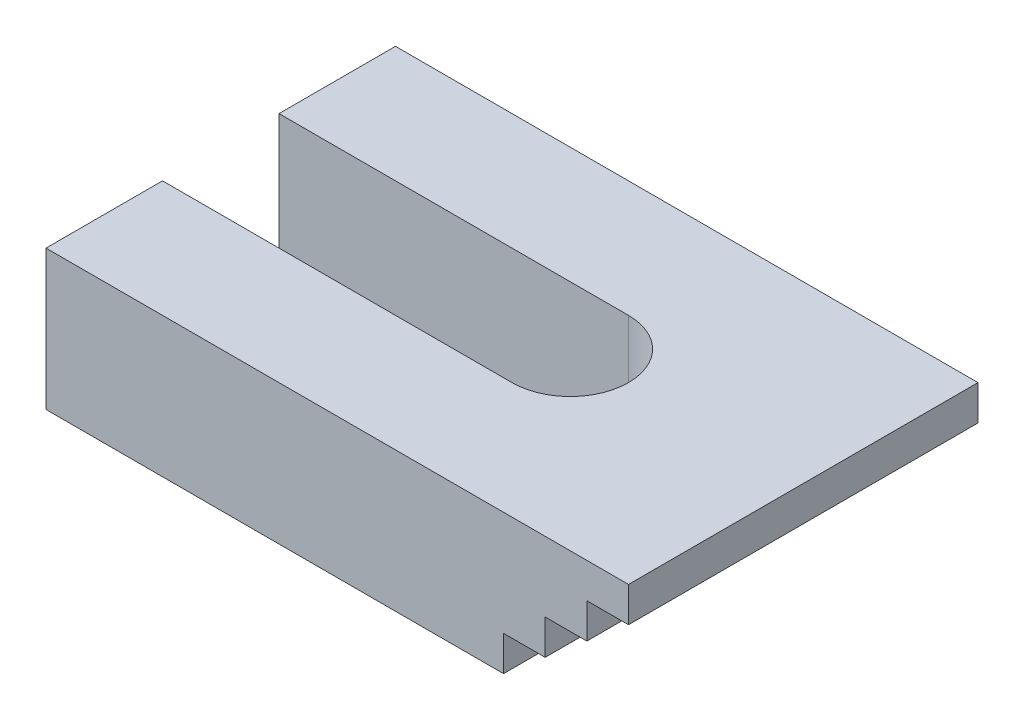
ISO-10303-21;
HEADER;
FILE_DESCRIPTION(('STEP AP214'),'2;1');
FILE_NAME('part.step','',(''),(''),'','','');
FILE_SCHEMA(('AUTOMOTIVE_DESIGN { 1 0 10303 214 1 1 1 1 }'));
ENDSEC;
DATA;
#1=APPLICATION_CONTEXT('core data for automotive mechanical design processes');
#2=APPLICATION_PROTOCOL_DEFINITION('international standard','automotive_design',2000,#1);
#3=PRODUCT_CONTEXT('',#1,'mechanical');
#4=PRODUCT('Part','Part','',(#3));
#5=PRODUCT_RELATED_PRODUCT_CATEGORY('part','',(#4));
#6=PRODUCT_DEFINITION_FORMATION('','',#4);
#7=PRODUCT_DEFINITION_CONTEXT('part definition',#1,'design');
#8=PRODUCT_DEFINITION('design','',#6,#7);
#9=PRODUCT_DEFINITION_SHAPE('','',#8);
#10=(LENGTH_UNIT() NAMED_UNIT(*) SI_UNIT(.MILLI.,.METRE.));
#11=(NAMED_UNIT(*) PLANE_ANGLE_UNIT() SI_UNIT($,.RADIAN.));
#12=(NAMED_UNIT(*) SI_UNIT($,.STERADIAN.) SOLID_ANGLE_UNIT());
#13=UNCERTAINTY_MEASURE_WITH_UNIT(LENGTH_MEASURE(1.E-05),#10,'distance_accuracy_value','');
#14=(GEOMETRIC_REPRESENTATION_CONTEXT(3) GLOBAL_UNCERTAINTY_ASSIGNED_CONTEXT((#13)) GLOBAL_UNIT_ASSIGNED_CONTEXT((#10,
#11,#12)) REPRESENTATION_CONTEXT('',''));
#15=CARTESIAN_POINT('',(0.,0.,0.));
#16=DIRECTION('',(0.,0.,1.));
#17=DIRECTION('',(1.,0.,0.));
#18=AXIS2_PLACEMENT_3D('',#15,#16,#17);
#19=CARTESIAN_POINT('',(-39.274217666652,0.,30.));
#20=DIRECTION('',(1.,0.,0.));
#21=DIRECTION('',(0.,0.,-1.));
#22=AXIS2_PLACEMENT_3D('',#19,#20,#21);
#23=PLANE('',#22);
#24=DIRECTION('',(0.,0.,-1.));
#25=VECTOR('',#24,1.);
#26=CARTESIAN_POINT('',(-39.274217666652,0.,30.));
#27=LINE('',#26,#25);
#28=CARTESIAN_POINT('',(-39.274217666652,0.,9.99999999999999));
#29=VERTEX_POINT('',#28);
#30=CARTESIAN_POINT('',(-39.274217666652,0.,0.));
#31=VERTEX_POINT('',#30);
#32=EDGE_CURVE('E206',#29,#31,#27,.T.);
#33=ORIENTED_EDGE('',*,*,#32,.F.);
#34=DIRECTION('',(0.,-1.,0.));
#35=VECTOR('',#34,1.);
#36=CARTESIAN_POINT('',(-39.274217666652,12.,9.99999999999999));
#37=LINE('',#36,#35);
#38=CARTESIAN_POINT('',(-39.274217666652,12.,9.99999999999999));
#39=VERTEX_POINT('',#38);
#40=EDGE_CURVE('E273',#39,#29,#37,.T.);
#41=ORIENTED_EDGE('',*,*,#40,.F.);
#42=DIRECTION('',(0.,0.,-1.));
#43=VECTOR('',#42,1.);
#44=CARTESIAN_POINT('',(-39.274217666652,12.,30.));
#45=LINE('',#44,#43);
#46=CARTESIAN_POINT('',(-39.274217666652,12.,0.));
#47=VERTEX_POINT('',#46);
#48=EDGE_CURVE('E158',#39,#47,#45,.T.);
#49=ORIENTED_EDGE('',*,*,#48,.T.);
#50=DIRECTION('',(0.,-1.,0.));
#51=VECTOR('',#50,1.);
#52=CARTESIAN_POINT('',(-39.274217666652,0.,0.));
#53=LINE('',#52,#51);
#54=EDGE_CURVE('E197',#47,#31,#53,.T.);
#55=ORIENTED_EDGE('',*,*,#54,.T.);
#56=EDGE_LOOP('',(#33,#41,#49,#55));
#57=FACE_BOUND('',#56,.T.);
#58=ADVANCED_FACE('F39',(#57),#23,.F.);
#59=CARTESIAN_POINT('',(0.,0.,30.));
#60=DIRECTION('',(-1.,0.,0.));
#61=DIRECTION('',(0.,0.,1.));
#62=AXIS2_PLACEMENT_3D('',#59,#60,#61);
#63=PLANE('',#62);
#64=DIRECTION('',(0.,1.,0.));
#65=VECTOR('',#64,1.);
#66=CARTESIAN_POINT('',(0.,0.,0.));
#67=LINE('',#66,#65);
#68=CARTESIAN_POINT('',(0.,0.,0.));
#69=VERTEX_POINT('',#68);
#70=CARTESIAN_POINT('',(0.,3.,0.));
#71=VERTEX_POINT('',#70);
#72=EDGE_CURVE('E170',#69,#71,#67,.T.);
#73=ORIENTED_EDGE('',*,*,#72,.T.);
#74=DIRECTION('',(0.,0.,-1.));
#75=VECTOR('',#74,1.);
#76=CARTESIAN_POINT('',(0.,3.,30.));
#77=LINE('',#76,#75);
#78=CARTESIAN_POINT('',(0.,3.,30.));
#79=VERTEX_POINT('',#78);
#80=EDGE_CURVE('E11',#79,#71,#77,.T.);
#81=ORIENTED_EDGE('',*,*,#80,.F.);
#82=DIRECTION('',(0.,1.,0.));
#83=VECTOR('',#82,1.);
#84=CARTESIAN_POINT('',(0.,0.,30.));
#85=LINE('',#84,#83);
#86=CARTESIAN_POINT('',(0.,0.,30.));
#87=VERTEX_POINT('',#86);
#88=EDGE_CURVE('E203',#87,#79,#85,.T.);
#89=ORIENTED_EDGE('',*,*,#88,.F.);
#90=DIRECTION('',(0.,0.,-1.));
#91=VECTOR('',#90,1.);
#92=CARTESIAN_POINT('',(0.,0.,30.));
#93=LINE('',#92,#91);
#94=EDGE_CURVE('E166',#87,#69,#93,.T.);
#95=ORIENTED_EDGE('',*,*,#94,.T.);
#96=EDGE_LOOP('',(#73,#81,#89,#95));
#97=FACE_BOUND('',#96,.T.);
#98=ADVANCED_FACE('F41',(#97),#63,.F.);
#99=CARTESIAN_POINT('',(0.,3.,30.));
#100=DIRECTION('',(0.,1.,0.));
#101=DIRECTION('',(0.,0.,1.));
#102=AXIS2_PLACEMENT_3D('',#99,#100,#101);
#103=PLANE('',#102);
#104=DIRECTION('',(1.,0.,0.));
#105=VECTOR('',#104,1.);
#106=CARTESIAN_POINT('',(0.,3.,0.));
#107=LINE('',#106,#105);
#108=CARTESIAN_POINT('',(3.57526077778267,3.,0.));
#109=VERTEX_POINT('',#108);
#110=EDGE_CURVE('E174',#71,#109,#107,.T.);
#111=ORIENTED_EDGE('',*,*,#110,.T.);
#112=DIRECTION('',(0.,0.,-1.));
#113=VECTOR('',#112,1.);
#114=CARTESIAN_POINT('',(3.57526077778267,3.,30.));
#115=LINE('',#114,#113);
#116=CARTESIAN_POINT('',(3.57526077778267,3.,30.));
#117=VERTEX_POINT('',#116);
#118=EDGE_CURVE('E48',#117,#109,#115,.T.);
#119=ORIENTED_EDGE('',*,*,#118,.F.);
#120=DIRECTION('',(1.,0.,0.));
#121=VECTOR('',#120,1.);
#122=CARTESIAN_POINT('',(0.,3.,30.));
#123=LINE('',#122,#121);
#124=EDGE_CURVE('E110',#79,#117,#123,.T.);
#125=ORIENTED_EDGE('',*,*,#124,.F.);
#126=ORIENTED_EDGE('',*,*,#80,.T.);
#127=EDGE_LOOP('',(#111,#119,#125,#126));
#128=FACE_BOUND('',#127,.T.);
#129=ADVANCED_FACE('F340',(#128),#103,.F.);
#130=CARTESIAN_POINT('',(3.57526077778267,3.,30.));
#131=DIRECTION('',(-1.,0.,0.));
#132=DIRECTION('',(0.,0.,1.));
#133=AXIS2_PLACEMENT_3D('',#130,#131,#132);
#134=PLANE('',#133);
#135=DIRECTION('',(0.,1.,0.));
#136=VECTOR('',#135,1.);
#137=CARTESIAN_POINT('',(3.57526077778267,3.,0.));
#138=LINE('',#137,#136);
#139=CARTESIAN_POINT('',(3.57526077778267,6.,0.));
#140=VERTEX_POINT('',#139);
#141=EDGE_CURVE('E178',#109,#140,#138,.T.);
#142=ORIENTED_EDGE('',*,*,#141,.T.);
#143=DIRECTION('',(0.,0.,-1.));
#144=VECTOR('',#143,1.);
#145=CARTESIAN_POINT('',(3.57526077778267,6.,30.));
#146=LINE('',#145,#144);
#147=CARTESIAN_POINT('',(3.57526077778267,6.,30.));
#148=VERTEX_POINT('',#147);
#149=EDGE_CURVE('E223',#148,#140,#146,.T.);
#150=ORIENTED_EDGE('',*,*,#149,.F.);
#151=DIRECTION('',(0.,1.,0.));
#152=VECTOR('',#151,1.);
#153=CARTESIAN_POINT('',(3.57526077778267,3.,30.));
#154=LINE('',#153,#152);
#155=EDGE_CURVE('E233',#117,#148,#154,.T.);
#156=ORIENTED_EDGE('',*,*,#155,.F.);
#157=ORIENTED_EDGE('',*,*,#118,.T.);
#158=EDGE_LOOP('',(#142,#150,#156,#157));
#159=FACE_BOUND('',#158,.T.);
#160=ADVANCED_FACE('F231',(#159),#134,.F.);
#161=CARTESIAN_POINT('',(3.57526077778267,6.,30.));
#162=DIRECTION('',(0.,1.,0.));
#163=DIRECTION('',(0.,0.,1.));
#164=AXIS2_PLACEMENT_3D('',#161,#162,#163);
#165=PLANE('',#164);
#166=DIRECTION('',(1.,0.,0.));
#167=VECTOR('',#166,1.);
#168=CARTESIAN_POINT('',(3.57526077778267,6.,0.));
#169=LINE('',#168,#167);
#170=CARTESIAN_POINT('',(7.15052155556534,6.,0.));
#171=VERTEX_POINT('',#170);
#172=EDGE_CURVE('E181',#140,#171,#169,.T.);
#173=ORIENTED_EDGE('',*,*,#172,.T.);
#174=DIRECTION('',(0.,0.,-1.));
#175=VECTOR('',#174,1.);
#176=CARTESIAN_POINT('',(7.15052155556534,6.,30.));
#177=LINE('',#176,#175);
#178=CARTESIAN_POINT('',(7.15052155556534,6.,30.));
#179=VERTEX_POINT('',#178);
#180=EDGE_CURVE('E219',#179,#171,#177,.T.);
#181=ORIENTED_EDGE('',*,*,#180,.F.);
#182=DIRECTION('',(1.,0.,0.));
#183=VECTOR('',#182,1.);
#184=CARTESIAN_POINT('',(3.57526077778267,6.,30.));
#185=LINE('',#184,#183);
#186=EDGE_CURVE('E252',#148,#179,#185,.T.);
#187=ORIENTED_EDGE('',*,*,#186,.F.);
#188=ORIENTED_EDGE('',*,*,#149,.T.);
#189=EDGE_LOOP('',(#173,#181,#187,#188));
#190=FACE_BOUND('',#189,.T.);
#191=ADVANCED_FACE('F242',(#190),#165,.F.);
#192=CARTESIAN_POINT('',(7.15052155556534,6.,30.));
#193=DIRECTION('',(-1.,0.,0.));
#194=DIRECTION('',(0.,0.,1.));
#195=AXIS2_PLACEMENT_3D('',#192,#193,#194);
#196=PLANE('',#195);
#197=DIRECTION('',(0.,1.,0.));
#198=VECTOR('',#197,1.);
#199=CARTESIAN_POINT('',(7.15052155556534,6.,0.));
#200=LINE('',#199,#198);
#201=CARTESIAN_POINT('',(7.15052155556534,9.,0.));
#202=VERTEX_POINT('',#201);
#203=EDGE_CURVE('E184',#171,#202,#200,.T.);
#204=ORIENTED_EDGE('',*,*,#203,.T.);
#205=DIRECTION('',(0.,0.,-1.));
#206=VECTOR('',#205,1.);
#207=CARTESIAN_POINT('',(7.15052155556534,9.,30.));
#208=LINE('',#207,#206);
#209=CARTESIAN_POINT('',(7.15052155556534,9.,30.));
#210=VERTEX_POINT('',#209);
#211=EDGE_CURVE('E215',#210,#202,#208,.T.);
#212=ORIENTED_EDGE('',*,*,#211,.F.);
#213=DIRECTION('',(0.,1.,0.));
#214=VECTOR('',#213,1.);
#215=CARTESIAN_POINT('',(7.15052155556534,6.,30.));
#216=LINE('',#215,#214);
#217=EDGE_CURVE('E248',#179,#210,#216,.T.);
#218=ORIENTED_EDGE('',*,*,#217,.F.);
#219=ORIENTED_EDGE('',*,*,#180,.T.);
#220=EDGE_LOOP('',(#204,#212,#218,#219));
#221=FACE_BOUND('',#220,.T.);
#222=ADVANCED_FACE('F246',(#221),#196,.F.);
#223=CARTESIAN_POINT('',(7.15052155556534,9.,30.));
#224=DIRECTION('',(0.,1.,0.));
#225=DIRECTION('',(0.,0.,1.));
#226=AXIS2_PLACEMENT_3D('',#223,#224,#225);
#227=PLANE('',#226);
#228=DIRECTION('',(1.,0.,0.));
#229=VECTOR('',#228,1.);
#230=CARTESIAN_POINT('',(7.15052155556534,9.,0.));
#231=LINE('',#230,#229);
#232=CARTESIAN_POINT('',(10.725782333348,9.,0.));
#233=VERTEX_POINT('',#232);
#234=EDGE_CURVE('E187',#202,#233,#231,.T.);
#235=ORIENTED_EDGE('',*,*,#234,.T.);
#236=DIRECTION('',(0.,0.,-1.));
#237=VECTOR('',#236,1.);
#238=CARTESIAN_POINT('',(10.725782333348,9.,30.));
#239=LINE('',#238,#237);
#240=CARTESIAN_POINT('',(10.725782333348,9.,30.));
#241=VERTEX_POINT('',#240);
#242=EDGE_CURVE('E211',#241,#233,#239,.T.);
#243=ORIENTED_EDGE('',*,*,#242,.F.);
#244=DIRECTION('',(1.,0.,0.));
#245=VECTOR('',#244,1.);
#246=CARTESIAN_POINT('',(7.15052155556534,9.,30.));
#247=LINE('',#246,#245);
#248=EDGE_CURVE('E251',#210,#241,#247,.T.);
#249=ORIENTED_EDGE('',*,*,#248,.F.);
#250=ORIENTED_EDGE('',*,*,#211,.T.);
#251=EDGE_LOOP('',(#235,#243,#249,#250));
#252=FACE_BOUND('',#251,.T.);
#253=ADVANCED_FACE('F352',(#252),#227,.F.);
#254=CARTESIAN_POINT('',(10.725782333348,9.,30.));
#255=DIRECTION('',(-1.,0.,0.));
#256=DIRECTION('',(0.,0.,1.));
#257=AXIS2_PLACEMENT_3D('',#254,#255,#256);
#258=PLANE('',#257);
#259=DIRECTION('',(0.,1.,0.));
#260=VECTOR('',#259,1.);
#261=CARTESIAN_POINT('',(10.725782333348,9.,0.));
#262=LINE('',#261,#260);
#263=CARTESIAN_POINT('',(10.725782333348,12.,0.));
#264=VERTEX_POINT('',#263);
#265=EDGE_CURVE('E190',#233,#264,#262,.T.);
#266=ORIENTED_EDGE('',*,*,#265,.T.);
#267=DIRECTION('',(0.,0.,-1.));
#268=VECTOR('',#267,1.);
#269=CARTESIAN_POINT('',(10.725782333348,12.,30.));
#270=LINE('',#269,#268);
#271=CARTESIAN_POINT('',(10.725782333348,12.,30.));
#272=VERTEX_POINT('',#271);
#273=EDGE_CURVE('E157',#272,#264,#270,.T.);
#274=ORIENTED_EDGE('',*,*,#273,.F.);
#275=DIRECTION('',(0.,1.,0.));
#276=VECTOR('',#275,1.);
#277=CARTESIAN_POINT('',(10.725782333348,9.,30.));
#278=LINE('',#277,#276);
#279=EDGE_CURVE('E139',#241,#272,#278,.T.);
#280=ORIENTED_EDGE('',*,*,#279,.F.);
#281=ORIENTED_EDGE('',*,*,#242,.T.);
#282=EDGE_LOOP('',(#266,#274,#280,#281));
#283=FACE_BOUND('',#282,.T.);
#284=ADVANCED_FACE('F348',(#283),#258,.F.);
#285=CARTESIAN_POINT('',(10.725782333348,12.,30.));
#286=DIRECTION('',(0.,-1.,0.));
#287=DIRECTION('',(1.,0.,0.));
#288=AXIS2_PLACEMENT_3D('',#285,#286,#287);
#289=PLANE('',#288);
#290=ORIENTED_EDGE('',*,*,#48,.F.);
#291=DIRECTION('',(1.,0.,0.));
#292=VECTOR('',#291,1.);
#293=CARTESIAN_POINT('',(-9.27421766665199,12.,10.));
#294=LINE('',#293,#292);
#295=CARTESIAN_POINT('',(-9.27421766665199,12.,10.));
#296=VERTEX_POINT('',#295);
#297=EDGE_CURVE('E270',#39,#296,#294,.T.);
#298=ORIENTED_EDGE('',*,*,#297,.T.);
#299=CARTESIAN_POINT('',(-9.27421766665199,12.,15.));
#300=DIRECTION('',(0.,-1.,0.));
#301=DIRECTION('',(0.,0.,-1.));
#302=AXIS2_PLACEMENT_3D('',#299,#300,#301);
#303=CIRCLE('',#302,5.);
#304=CARTESIAN_POINT('',(-9.27421766665199,12.,20.));
#305=VERTEX_POINT('',#304);
#306=EDGE_CURVE('E283',#296,#305,#303,.T.);
#307=ORIENTED_EDGE('',*,*,#306,.T.);
#308=DIRECTION('',(-1.,0.,0.));
#309=VECTOR('',#308,1.);
#310=CARTESIAN_POINT('',(-9.27421766665199,12.,20.));
#311=LINE('',#310,#309);
#312=CARTESIAN_POINT('',(-39.274217666652,12.,20.));
#313=VERTEX_POINT('',#312);
#314=EDGE_CURVE('E153',#305,#313,#311,.T.);
#315=ORIENTED_EDGE('',*,*,#314,.T.);
#316=CARTESIAN_POINT('',(-39.274217666652,12.,30.));
#317=VERTEX_POINT('',#316);
#318=EDGE_CURVE('E147',#317,#313,#45,.T.);
#319=ORIENTED_EDGE('',*,*,#318,.F.);
#320=DIRECTION('',(-1.,0.,0.));
#321=VECTOR('',#320,1.);
#322=CARTESIAN_POINT('',(10.725782333348,12.,30.));
#323=LINE('',#322,#321);
#324=EDGE_CURVE('E132',#272,#317,#323,.T.);
#325=ORIENTED_EDGE('',*,*,#324,.F.);
#326=ORIENTED_EDGE('',*,*,#273,.T.);
#327=DIRECTION('',(-1.,0.,0.));
#328=VECTOR('',#327,1.);
#329=CARTESIAN_POINT('',(10.725782333348,12.,0.));
#330=LINE('',#329,#328);
#331=EDGE_CURVE('E193',#264,#47,#330,.T.);
#332=ORIENTED_EDGE('',*,*,#331,.T.);
#333=EDGE_LOOP('',(#290,#298,#307,#315,#319,#325,#326,#332));
#334=FACE_BOUND('',#333,.T.);
#335=ADVANCED_FACE('F149',(#334),#289,.F.);
#336=ORIENTED_EDGE('',*,*,#318,.T.);
#337=DIRECTION('',(0.,-1.,0.));
#338=VECTOR('',#337,1.);
#339=CARTESIAN_POINT('',(-39.274217666652,12.,20.));
#340=LINE('',#339,#338);
#341=CARTESIAN_POINT('',(-39.274217666652,0.,20.));
#342=VERTEX_POINT('',#341);
#343=EDGE_CURVE('E269',#313,#342,#340,.T.);
#344=ORIENTED_EDGE('',*,*,#343,.T.);
#345=CARTESIAN_POINT('',(-39.274217666652,0.,30.));
#346=VERTEX_POINT('',#345);
#347=EDGE_CURVE('E162',#346,#342,#27,.T.);
#348=ORIENTED_EDGE('',*,*,#347,.F.);
#349=DIRECTION('',(0.,-1.,0.));
#350=VECTOR('',#349,1.);
#351=CARTESIAN_POINT('',(-39.274217666652,0.,30.));
#352=LINE('',#351,#350);
#353=EDGE_CURVE('E136',#317,#346,#352,.T.);
#354=ORIENTED_EDGE('',*,*,#353,.F.);
#355=EDGE_LOOP('',(#336,#344,#348,#354));
#356=FACE_BOUND('',#355,.T.);
#357=ADVANCED_FACE('F160',(#356),#23,.F.);
#358=CARTESIAN_POINT('',(0.,0.,30.));
#359=DIRECTION('',(0.,1.,0.));
#360=DIRECTION('',(-1.,0.,0.));
#361=AXIS2_PLACEMENT_3D('',#358,#359,#360);
#362=PLANE('',#361);
#363=CARTESIAN_POINT('',(-9.27421766665199,0.,15.));
#364=DIRECTION('',(0.,-1.,0.));
#365=DIRECTION('',(0.,0.,-1.));
#366=AXIS2_PLACEMENT_3D('',#363,#364,#365);
#367=CIRCLE('',#366,5.);
#368=CARTESIAN_POINT('',(-9.27421766665199,0.,10.));
#369=VERTEX_POINT('',#368);
#370=CARTESIAN_POINT('',(-9.27421766665199,0.,20.));
#371=VERTEX_POINT('',#370);
#372=EDGE_CURVE('E55',#369,#371,#367,.T.);
#373=ORIENTED_EDGE('',*,*,#372,.F.);
#374=DIRECTION('',(1.,0.,0.));
#375=VECTOR('',#374,1.);
#376=CARTESIAN_POINT('',(-9.27421766665199,0.,10.));
#377=LINE('',#376,#375);
#378=EDGE_CURVE('E279',#29,#369,#377,.T.);
#379=ORIENTED_EDGE('',*,*,#378,.F.);
#380=ORIENTED_EDGE('',*,*,#32,.T.);
#381=DIRECTION('',(1.,0.,0.));
#382=VECTOR('',#381,1.);
#383=CARTESIAN_POINT('',(0.,0.,0.));
#384=LINE('',#383,#382);
#385=EDGE_CURVE('E102',#31,#69,#384,.T.);
#386=ORIENTED_EDGE('',*,*,#385,.T.);
#387=ORIENTED_EDGE('',*,*,#94,.F.);
#388=DIRECTION('',(1.,0.,0.));
#389=VECTOR('',#388,1.);
#390=CARTESIAN_POINT('',(0.,0.,30.));
#391=LINE('',#390,#389);
#392=EDGE_CURVE('E64',#346,#87,#391,.T.);
#393=ORIENTED_EDGE('',*,*,#392,.F.);
#394=ORIENTED_EDGE('',*,*,#347,.T.);
#395=DIRECTION('',(-1.,0.,0.));
#396=VECTOR('',#395,1.);
#397=CARTESIAN_POINT('',(-9.27421766665199,0.,20.));
#398=LINE('',#397,#396);
#399=EDGE_CURVE('E284',#371,#342,#398,.T.);
#400=ORIENTED_EDGE('',*,*,#399,.F.);
#401=EDGE_LOOP('',(#373,#379,#380,#386,#387,#393,#394,#400));
#402=FACE_BOUND('',#401,.T.);
#403=ADVANCED_FACE('F315',(#402),#362,.F.);
#404=CARTESIAN_POINT('',(0.,0.,30.));
#405=DIRECTION('',(0.,0.,-1.));
#406=DIRECTION('',(-1.,0.,0.));
#407=AXIS2_PLACEMENT_3D('',#404,#405,#406);
#408=PLANE('',#407);
#409=ORIENTED_EDGE('',*,*,#88,.T.);
#410=ORIENTED_EDGE('',*,*,#124,.T.);
#411=ORIENTED_EDGE('',*,*,#155,.T.);
#412=ORIENTED_EDGE('',*,*,#186,.T.);
#413=ORIENTED_EDGE('',*,*,#217,.T.);
#414=ORIENTED_EDGE('',*,*,#248,.T.);
#415=ORIENTED_EDGE('',*,*,#279,.T.);
#416=ORIENTED_EDGE('',*,*,#324,.T.);
#417=ORIENTED_EDGE('',*,*,#353,.T.);
#418=ORIENTED_EDGE('',*,*,#392,.T.);
#419=EDGE_LOOP('',(#409,#410,#411,#412,#413,#414,#415,#416,#417,#418));
#420=FACE_BOUND('',#419,.T.);
#421=ADVANCED_FACE('F134',(#420),#408,.F.);
#422=CARTESIAN_POINT('',(0.,0.,0.));
#423=DIRECTION('',(0.,0.,-1.));
#424=DIRECTION('',(-1.,0.,0.));
#425=AXIS2_PLACEMENT_3D('',#422,#423,#424);
#426=PLANE('',#425);
#427=ORIENTED_EDGE('',*,*,#72,.F.);
#428=ORIENTED_EDGE('',*,*,#385,.F.);
#429=ORIENTED_EDGE('',*,*,#54,.F.);
#430=ORIENTED_EDGE('',*,*,#331,.F.);
#431=ORIENTED_EDGE('',*,*,#265,.F.);
#432=ORIENTED_EDGE('',*,*,#234,.F.);
#433=ORIENTED_EDGE('',*,*,#203,.F.);
#434=ORIENTED_EDGE('',*,*,#172,.F.);
#435=ORIENTED_EDGE('',*,*,#141,.F.);
#436=ORIENTED_EDGE('',*,*,#110,.F.);
#437=EDGE_LOOP('',(#427,#428,#429,#430,#431,#432,#433,#434,#435,#436));
#438=FACE_BOUND('',#437,.T.);
#439=ADVANCED_FACE('F237',(#438),#426,.T.);
#440=CARTESIAN_POINT('',(-9.27421766665199,12.,15.));
#441=DIRECTION('',(0.,-1.,0.));
#442=DIRECTION('',(0.,0.,-1.));
#443=AXIS2_PLACEMENT_3D('',#440,#441,#442);
#444=CYLINDRICAL_SURFACE('',#443,5.);
#445=ORIENTED_EDGE('',*,*,#372,.T.);
#446=DIRECTION('',(0.,-1.,0.));
#447=VECTOR('',#446,1.);
#448=CARTESIAN_POINT('',(-9.27421766665199,12.,20.));
#449=LINE('',#448,#447);
#450=EDGE_CURVE('E266',#305,#371,#449,.T.);
#451=ORIENTED_EDGE('',*,*,#450,.F.);
#452=ORIENTED_EDGE('',*,*,#306,.F.);
#453=DIRECTION('',(0.,-1.,0.));
#454=VECTOR('',#453,1.);
#455=CARTESIAN_POINT('',(-9.27421766665199,12.,10.));
#456=LINE('',#455,#454);
#457=EDGE_CURVE('E175',#296,#369,#456,.T.);
#458=ORIENTED_EDGE('',*,*,#457,.T.);
#459=EDGE_LOOP('',(#445,#451,#452,#458));
#460=FACE_BOUND('',#459,.T.);
#461=ADVANCED_FACE('F300',(#460),#444,.F.);
#462=CARTESIAN_POINT('',(-9.27421766665199,12.,10.));
#463=DIRECTION('',(0.,0.,-1.));
#464=DIRECTION('',(-1.,0.,0.));
#465=AXIS2_PLACEMENT_3D('',#462,#463,#464);
#466=PLANE('',#465);
#467=ORIENTED_EDGE('',*,*,#378,.T.);
#468=ORIENTED_EDGE('',*,*,#457,.F.);
#469=ORIENTED_EDGE('',*,*,#297,.F.);
#470=ORIENTED_EDGE('',*,*,#40,.T.);
#471=EDGE_LOOP('',(#467,#468,#469,#470));
#472=FACE_BOUND('',#471,.T.);
#473=ADVANCED_FACE('F312',(#472),#466,.F.);
#474=CARTESIAN_POINT('',(-9.27421766665199,12.,20.));
#475=DIRECTION('',(0.,0.,1.));
#476=DIRECTION('',(1.,0.,0.));
#477=AXIS2_PLACEMENT_3D('',#474,#475,#476);
#478=PLANE('',#477);
#479=ORIENTED_EDGE('',*,*,#399,.T.);
#480=ORIENTED_EDGE('',*,*,#343,.F.);
#481=ORIENTED_EDGE('',*,*,#314,.F.);
#482=ORIENTED_EDGE('',*,*,#450,.T.);
#483=EDGE_LOOP('',(#479,#480,#481,#482));
#484=FACE_BOUND('',#483,.T.);
#485=ADVANCED_FACE('F327',(#484),#478,.F.);
#486=CLOSED_SHELL('',(#58,#98,#129,#160,#191,#222,#253,#284,#335,#357,#403,#421,#439,#461,#473,#485));
#487=MANIFOLD_SOLID_BREP('B2',#486);
#488=ADVANCED_BREP_SHAPE_REPRESENTATION('',(#18,#487),#14);
#489=SHAPE_DEFINITION_REPRESENTATION(#9,#488);
ENDSEC;
END-ISO-10303-21;
